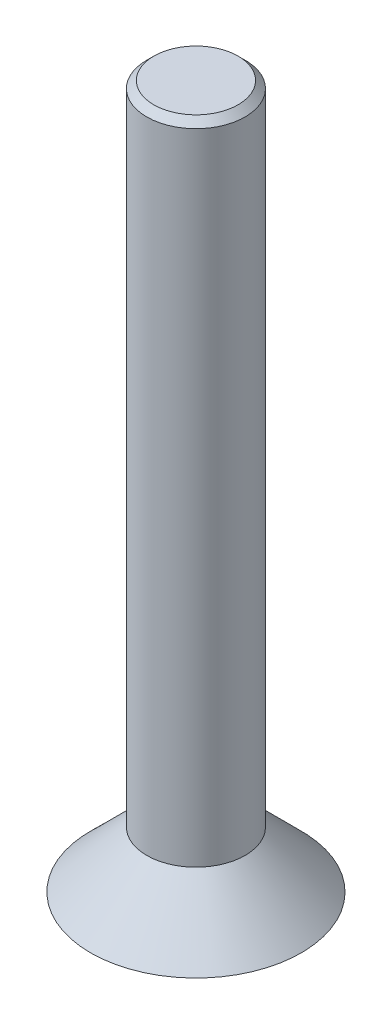
ISO-10303-21;
HEADER;
FILE_DESCRIPTION(('STEP AP214'),'2;1');
FILE_NAME('part.step','',(''),(''),'','','');
FILE_SCHEMA(('AUTOMOTIVE_DESIGN { 1 0 10303 214 1 1 1 1 }'));
ENDSEC;
DATA;
#1=APPLICATION_CONTEXT('core data for automotive mechanical design processes');
#2=APPLICATION_PROTOCOL_DEFINITION('international standard','automotive_design',2000,#1);
#3=PRODUCT_CONTEXT('',#1,'mechanical');
#4=PRODUCT('Part','Part','',(#3));
#5=PRODUCT_RELATED_PRODUCT_CATEGORY('part','',(#4));
#6=PRODUCT_DEFINITION_FORMATION('','',#4);
#7=PRODUCT_DEFINITION_CONTEXT('part definition',#1,'design');
#8=PRODUCT_DEFINITION('design','',#6,#7);
#9=PRODUCT_DEFINITION_SHAPE('','',#8);
#10=(LENGTH_UNIT() NAMED_UNIT(*) SI_UNIT(.MILLI.,.METRE.));
#11=(NAMED_UNIT(*) PLANE_ANGLE_UNIT() SI_UNIT($,.RADIAN.));
#12=(NAMED_UNIT(*) SI_UNIT($,.STERADIAN.) SOLID_ANGLE_UNIT());
#13=UNCERTAINTY_MEASURE_WITH_UNIT(LENGTH_MEASURE(1.E-05),#10,'distance_accuracy_value','');
#14=(GEOMETRIC_REPRESENTATION_CONTEXT(3) GLOBAL_UNCERTAINTY_ASSIGNED_CONTEXT((#13)) GLOBAL_UNIT_ASSIGNED_CONTEXT((#10,
#11,#12)) REPRESENTATION_CONTEXT('',''));
#15=CARTESIAN_POINT('',(0.,0.,0.));
#16=DIRECTION('',(0.,0.,1.));
#17=DIRECTION('',(1.,0.,0.));
#18=AXIS2_PLACEMENT_3D('',#15,#16,#17);
#19=CARTESIAN_POINT('',(0.,0.,0.));
#20=DIRECTION('',(0.,1.,0.));
#21=DIRECTION('',(0.,0.,1.));
#22=AXIS2_PLACEMENT_3D('',#19,#20,#21);
#23=PLANE('',#22);
#24=CARTESIAN_POINT('',(0.,0.,0.));
#25=DIRECTION('',(0.,1.,0.));
#26=DIRECTION('',(0.,0.,1.));
#27=AXIS2_PLACEMENT_3D('',#24,#25,#26);
#28=CIRCLE('',#27,3.);
#29=CARTESIAN_POINT('',(0.,0.,3.));
#30=VERTEX_POINT('',#29);
#31=EDGE_CURVE('E139',#30,#30,#28,.T.);
#32=ORIENTED_EDGE('',*,*,#31,.F.);
#33=EDGE_LOOP('',(#32));
#34=FACE_BOUND('',#33,.T.);
#35=DIRECTION('',(0.866025403784439,0.,0.5));
#36=VECTOR('',#35,1.);
#37=CARTESIAN_POINT('',(-1.,0.,0.577350269189626));
#38=LINE('',#37,#36);
#39=CARTESIAN_POINT('',(-1.,0.,0.577350269189626));
#40=VERTEX_POINT('',#39);
#41=CARTESIAN_POINT('',(0.,0.,1.15470053837925));
#42=VERTEX_POINT('',#41);
#43=EDGE_CURVE('E58',#40,#42,#38,.T.);
#44=ORIENTED_EDGE('',*,*,#43,.T.);
#45=DIRECTION('',(0.866025403784438,0.,-0.5));
#46=VECTOR('',#45,1.);
#47=CARTESIAN_POINT('',(0.,0.,1.15470053837925));
#48=LINE('',#47,#46);
#49=CARTESIAN_POINT('',(1.,0.,0.577350269189626));
#50=VERTEX_POINT('',#49);
#51=EDGE_CURVE('E118',#42,#50,#48,.T.);
#52=ORIENTED_EDGE('',*,*,#51,.T.);
#53=DIRECTION('',(0.,0.,-1.));
#54=VECTOR('',#53,1.);
#55=CARTESIAN_POINT('',(1.,0.,0.577350269189626));
#56=LINE('',#55,#54);
#57=CARTESIAN_POINT('',(0.999999999999999,0.,-0.577350269189626));
#58=VERTEX_POINT('',#57);
#59=EDGE_CURVE('E114',#50,#58,#56,.T.);
#60=ORIENTED_EDGE('',*,*,#59,.T.);
#61=DIRECTION('',(-0.866025403784439,0.,-0.5));
#62=VECTOR('',#61,1.);
#63=CARTESIAN_POINT('',(0.999999999999999,0.,-0.577350269189626));
#64=LINE('',#63,#62);
#65=CARTESIAN_POINT('',(0.,0.,-1.15470053837925));
#66=VERTEX_POINT('',#65);
#67=EDGE_CURVE('E93',#58,#66,#64,.T.);
#68=ORIENTED_EDGE('',*,*,#67,.T.);
#69=DIRECTION('',(-0.866025403784438,0.,0.5));
#70=VECTOR('',#69,1.);
#71=CARTESIAN_POINT('',(0.,0.,-1.15470053837925));
#72=LINE('',#71,#70);
#73=CARTESIAN_POINT('',(-1.,0.,-0.577350269189625));
#74=VERTEX_POINT('',#73);
#75=EDGE_CURVE('E103',#66,#74,#72,.T.);
#76=ORIENTED_EDGE('',*,*,#75,.T.);
#77=DIRECTION('',(0.,0.,1.));
#78=VECTOR('',#77,1.);
#79=CARTESIAN_POINT('',(-1.,0.,-0.577350269189625));
#80=LINE('',#79,#78);
#81=EDGE_CURVE('E110',#74,#40,#80,.T.);
#82=ORIENTED_EDGE('',*,*,#81,.T.);
#83=EDGE_LOOP('',(#44,#52,#60,#68,#76,#82));
#84=FACE_BOUND('',#83,.T.);
#85=ADVANCED_FACE('F41',(#34,#84),#23,.F.);
#86=CARTESIAN_POINT('',(-1.,1.6,0.577350269189626));
#87=DIRECTION('',(0.5,0.,-0.866025403784439));
#88=DIRECTION('',(-0.866025403784439,0.,-0.5));
#89=AXIS2_PLACEMENT_3D('',#86,#87,#88);
#90=PLANE('',#89);
#91=ORIENTED_EDGE('',*,*,#43,.F.);
#92=DIRECTION('',(0.,-1.,0.));
#93=VECTOR('',#92,1.);
#94=CARTESIAN_POINT('',(-1.,1.6,0.577350269189626));
#95=LINE('',#94,#93);
#96=CARTESIAN_POINT('',(-1.,1.6,0.577350269189626));
#97=VERTEX_POINT('',#96);
#98=EDGE_CURVE('E125',#97,#40,#95,.T.);
#99=ORIENTED_EDGE('',*,*,#98,.F.);
#100=DIRECTION('',(0.866025403784439,0.,0.5));
#101=VECTOR('',#100,1.);
#102=CARTESIAN_POINT('',(-1.,1.6,0.577350269189626));
#103=LINE('',#102,#101);
#104=CARTESIAN_POINT('',(0.,1.6,1.15470053837925));
#105=VERTEX_POINT('',#104);
#106=EDGE_CURVE('E124',#97,#105,#103,.T.);
#107=ORIENTED_EDGE('',*,*,#106,.T.);
#108=DIRECTION('',(0.,-1.,0.));
#109=VECTOR('',#108,1.);
#110=CARTESIAN_POINT('',(0.,1.6,1.15470053837925));
#111=LINE('',#110,#109);
#112=EDGE_CURVE('E136',#105,#42,#111,.T.);
#113=ORIENTED_EDGE('',*,*,#112,.T.);
#114=EDGE_LOOP('',(#91,#99,#107,#113));
#115=FACE_BOUND('',#114,.T.);
#116=ADVANCED_FACE('F161',(#115),#90,.T.);
#117=CARTESIAN_POINT('',(0.,1.6,1.15470053837925));
#118=DIRECTION('',(-0.5,0.,-0.866025403784438));
#119=DIRECTION('',(-0.866025403784439,0.,0.5));
#120=AXIS2_PLACEMENT_3D('',#117,#118,#119);
#121=PLANE('',#120);
#122=ORIENTED_EDGE('',*,*,#51,.F.);
#123=ORIENTED_EDGE('',*,*,#112,.F.);
#124=DIRECTION('',(0.866025403784438,0.,-0.5));
#125=VECTOR('',#124,1.);
#126=CARTESIAN_POINT('',(0.,1.6,1.15470053837925));
#127=LINE('',#126,#125);
#128=CARTESIAN_POINT('',(1.,1.6,0.577350269189626));
#129=VERTEX_POINT('',#128);
#130=EDGE_CURVE('E226',#105,#129,#127,.T.);
#131=ORIENTED_EDGE('',*,*,#130,.T.);
#132=DIRECTION('',(0.,-1.,0.));
#133=VECTOR('',#132,1.);
#134=CARTESIAN_POINT('',(1.,1.6,0.577350269189626));
#135=LINE('',#134,#133);
#136=EDGE_CURVE('E133',#129,#50,#135,.T.);
#137=ORIENTED_EDGE('',*,*,#136,.T.);
#138=EDGE_LOOP('',(#122,#123,#131,#137));
#139=FACE_BOUND('',#138,.T.);
#140=ADVANCED_FACE('F167',(#139),#121,.T.);
#141=CARTESIAN_POINT('',(1.,1.6,0.577350269189626));
#142=DIRECTION('',(-1.,0.,0.));
#143=DIRECTION('',(0.,0.,1.));
#144=AXIS2_PLACEMENT_3D('',#141,#142,#143);
#145=PLANE('',#144);
#146=ORIENTED_EDGE('',*,*,#59,.F.);
#147=ORIENTED_EDGE('',*,*,#136,.F.);
#148=DIRECTION('',(0.,0.,-1.));
#149=VECTOR('',#148,1.);
#150=CARTESIAN_POINT('',(1.,1.6,0.577350269189626));
#151=LINE('',#150,#149);
#152=CARTESIAN_POINT('',(0.999999999999999,1.6,-0.577350269189626));
#153=VERTEX_POINT('',#152);
#154=EDGE_CURVE('E223',#129,#153,#151,.T.);
#155=ORIENTED_EDGE('',*,*,#154,.T.);
#156=DIRECTION('',(0.,-1.,0.));
#157=VECTOR('',#156,1.);
#158=CARTESIAN_POINT('',(0.999999999999999,1.6,-0.577350269189626));
#159=LINE('',#158,#157);
#160=EDGE_CURVE('E99',#153,#58,#159,.T.);
#161=ORIENTED_EDGE('',*,*,#160,.T.);
#162=EDGE_LOOP('',(#146,#147,#155,#161));
#163=FACE_BOUND('',#162,.T.);
#164=ADVANCED_FACE('F199',(#163),#145,.T.);
#165=CARTESIAN_POINT('',(0.999999999999999,1.6,-0.577350269189626));
#166=DIRECTION('',(-0.5,0.,0.866025403784439));
#167=DIRECTION('',(0.866025403784439,0.,0.5));
#168=AXIS2_PLACEMENT_3D('',#165,#166,#167);
#169=PLANE('',#168);
#170=ORIENTED_EDGE('',*,*,#67,.F.);
#171=ORIENTED_EDGE('',*,*,#160,.F.);
#172=DIRECTION('',(-0.866025403784439,0.,-0.5));
#173=VECTOR('',#172,1.);
#174=CARTESIAN_POINT('',(0.999999999999999,1.6,-0.577350269189626));
#175=LINE('',#174,#173);
#176=CARTESIAN_POINT('',(0.,1.6,-1.15470053837925));
#177=VERTEX_POINT('',#176);
#178=EDGE_CURVE('E67',#153,#177,#175,.T.);
#179=ORIENTED_EDGE('',*,*,#178,.T.);
#180=DIRECTION('',(0.,-1.,0.));
#181=VECTOR('',#180,1.);
#182=CARTESIAN_POINT('',(0.,1.6,-1.15470053837925));
#183=LINE('',#182,#181);
#184=EDGE_CURVE('E88',#177,#66,#183,.T.);
#185=ORIENTED_EDGE('',*,*,#184,.T.);
#186=EDGE_LOOP('',(#170,#171,#179,#185));
#187=FACE_BOUND('',#186,.T.);
#188=ADVANCED_FACE('F90',(#187),#169,.T.);
#189=CARTESIAN_POINT('',(0.,1.6,-1.15470053837925));
#190=DIRECTION('',(0.5,0.,0.866025403784438));
#191=DIRECTION('',(0.866025403784439,0.,-0.5));
#192=AXIS2_PLACEMENT_3D('',#189,#190,#191);
#193=PLANE('',#192);
#194=ORIENTED_EDGE('',*,*,#75,.F.);
#195=ORIENTED_EDGE('',*,*,#184,.F.);
#196=DIRECTION('',(-0.866025403784438,0.,0.5));
#197=VECTOR('',#196,1.);
#198=CARTESIAN_POINT('',(0.,1.6,-1.15470053837925));
#199=LINE('',#198,#197);
#200=CARTESIAN_POINT('',(-1.,1.6,-0.577350269189625));
#201=VERTEX_POINT('',#200);
#202=EDGE_CURVE('E218',#177,#201,#199,.T.);
#203=ORIENTED_EDGE('',*,*,#202,.T.);
#204=DIRECTION('',(0.,-1.,0.));
#205=VECTOR('',#204,1.);
#206=CARTESIAN_POINT('',(-1.,1.6,-0.577350269189625));
#207=LINE('',#206,#205);
#208=EDGE_CURVE('E100',#201,#74,#207,.T.);
#209=ORIENTED_EDGE('',*,*,#208,.T.);
#210=EDGE_LOOP('',(#194,#195,#203,#209));
#211=FACE_BOUND('',#210,.T.);
#212=ADVANCED_FACE('F104',(#211),#193,.T.);
#213=CARTESIAN_POINT('',(-1.,1.6,-0.577350269189625));
#214=DIRECTION('',(1.,0.,0.));
#215=DIRECTION('',(0.,0.,-1.));
#216=AXIS2_PLACEMENT_3D('',#213,#214,#215);
#217=PLANE('',#216);
#218=ORIENTED_EDGE('',*,*,#81,.F.);
#219=ORIENTED_EDGE('',*,*,#208,.F.);
#220=DIRECTION('',(0.,0.,1.));
#221=VECTOR('',#220,1.);
#222=CARTESIAN_POINT('',(-1.,1.6,-0.577350269189625));
#223=LINE('',#222,#221);
#224=EDGE_CURVE('E128',#201,#97,#223,.T.);
#225=ORIENTED_EDGE('',*,*,#224,.T.);
#226=ORIENTED_EDGE('',*,*,#98,.T.);
#227=EDGE_LOOP('',(#218,#219,#225,#226));
#228=FACE_BOUND('',#227,.T.);
#229=ADVANCED_FACE('F177',(#228),#217,.T.);
#230=CARTESIAN_POINT('',(0.,1.6,0.));
#231=DIRECTION('',(0.,-1.,0.));
#232=DIRECTION('',(0.,0.,-1.));
#233=AXIS2_PLACEMENT_3D('',#230,#231,#232);
#234=CONICAL_SURFACE('',#233,1.4,0.785398163397447);
#235=ORIENTED_EDGE('',*,*,#31,.T.);
#236=EDGE_LOOP('',(#235));
#237=FACE_BOUND('',#236,.T.);
#238=CARTESIAN_POINT('',(0.,1.6,0.));
#239=DIRECTION('',(0.,1.,0.));
#240=DIRECTION('',(0.,0.,1.));
#241=AXIS2_PLACEMENT_3D('',#238,#239,#240);
#242=CIRCLE('',#241,1.4);
#243=CARTESIAN_POINT('',(0.,1.6,1.4));
#244=VERTEX_POINT('',#243);
#245=EDGE_CURVE('E143',#244,#244,#242,.T.);
#246=ORIENTED_EDGE('',*,*,#245,.F.);
#247=EDGE_LOOP('',(#246));
#248=FACE_BOUND('',#247,.T.);
#249=ADVANCED_FACE('F172',(#237,#248),#234,.T.);
#250=CARTESIAN_POINT('',(0.,1.6,0.));
#251=DIRECTION('',(0.,1.,0.));
#252=DIRECTION('',(0.,0.,1.));
#253=AXIS2_PLACEMENT_3D('',#250,#251,#252);
#254=PLANE('',#253);
#255=ORIENTED_EDGE('',*,*,#130,.F.);
#256=ORIENTED_EDGE('',*,*,#106,.F.);
#257=ORIENTED_EDGE('',*,*,#224,.F.);
#258=ORIENTED_EDGE('',*,*,#202,.F.);
#259=ORIENTED_EDGE('',*,*,#178,.F.);
#260=ORIENTED_EDGE('',*,*,#154,.F.);
#261=EDGE_LOOP('',(#255,#256,#257,#258,#259,#260));
#262=FACE_BOUND('',#261,.T.);
#263=ADVANCED_FACE('F176',(#262),#254,.F.);
#264=CARTESIAN_POINT('',(0.,20.,0.));
#265=DIRECTION('',(0.,-1.,0.));
#266=DIRECTION('',(0.,0.,-1.));
#267=AXIS2_PLACEMENT_3D('',#264,#265,#266);
#268=CYLINDRICAL_SURFACE('',#267,1.4);
#269=CARTESIAN_POINT('',(0.,19.8,0.));
#270=DIRECTION('',(0.,1.,0.));
#271=DIRECTION('',(0.,0.,1.));
#272=AXIS2_PLACEMENT_3D('',#269,#270,#271);
#273=CIRCLE('',#272,1.4);
#274=CARTESIAN_POINT('',(0.,19.8,1.4));
#275=VERTEX_POINT('',#274);
#276=EDGE_CURVE('E11',#275,#275,#273,.F.);
#277=ORIENTED_EDGE('',*,*,#276,.T.);
#278=EDGE_LOOP('',(#277));
#279=FACE_BOUND('',#278,.T.);
#280=ORIENTED_EDGE('',*,*,#245,.T.);
#281=EDGE_LOOP('',(#280));
#282=FACE_BOUND('',#281,.T.);
#283=ADVANCED_FACE('F157',(#279,#282),#268,.T.);
#284=CARTESIAN_POINT('',(0.,20.,0.));
#285=DIRECTION('',(0.,1.,0.));
#286=DIRECTION('',(0.,0.,1.));
#287=AXIS2_PLACEMENT_3D('',#284,#285,#286);
#288=PLANE('',#287);
#289=CARTESIAN_POINT('',(0.,20.,0.));
#290=DIRECTION('',(0.,1.,0.));
#291=DIRECTION('',(0.,0.,1.));
#292=AXIS2_PLACEMENT_3D('',#289,#290,#291);
#293=CIRCLE('',#292,1.2);
#294=CARTESIAN_POINT('',(0.,20.,1.2));
#295=VERTEX_POINT('',#294);
#296=EDGE_CURVE('E51',#295,#295,#293,.T.);
#297=ORIENTED_EDGE('',*,*,#296,.T.);
#298=EDGE_LOOP('',(#297));
#299=FACE_BOUND('',#298,.T.);
#300=ADVANCED_FACE('F150',(#299),#288,.T.);
#301=CARTESIAN_POINT('',(0.,20.,0.));
#302=DIRECTION('',(0.,-1.,0.));
#303=DIRECTION('',(0.,0.,-1.));
#304=AXIS2_PLACEMENT_3D('',#301,#302,#303);
#305=CONICAL_SURFACE('',#304,1.2,0.785398163397448);
#306=ORIENTED_EDGE('',*,*,#276,.F.);
#307=EDGE_LOOP('',(#306));
#308=FACE_BOUND('',#307,.T.);
#309=ORIENTED_EDGE('',*,*,#296,.F.);
#310=EDGE_LOOP('',(#309));
#311=FACE_BOUND('',#310,.T.);
#312=ADVANCED_FACE('F44',(#308,#311),#305,.T.);
#313=CLOSED_SHELL('',(#85,#116,#140,#164,#188,#212,#229,#249,#263,#283,#300,#312));
#314=MANIFOLD_SOLID_BREP('B2',#313);
#315=ADVANCED_BREP_SHAPE_REPRESENTATION('',(#18,#314),#14);
#316=SHAPE_DEFINITION_REPRESENTATION(#9,#315);
ENDSEC;
END-ISO-10303-21;
